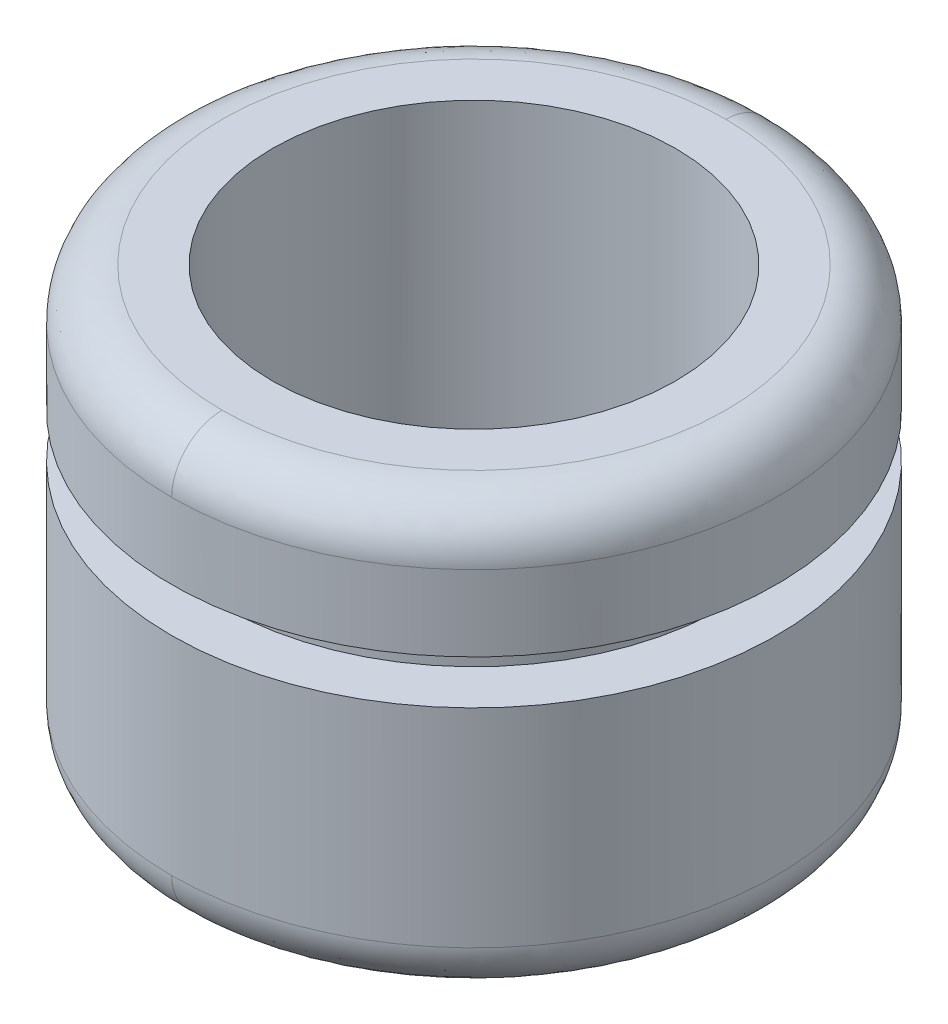
ISO-10303-21;
HEADER;
FILE_DESCRIPTION(('STEP AP214'),'2;1');
FILE_NAME('part.step','',(''),(''),'','','');
FILE_SCHEMA(('AUTOMOTIVE_DESIGN { 1 0 10303 214 1 1 1 1 }'));
ENDSEC;
DATA;
#1=APPLICATION_CONTEXT('core data for automotive mechanical design processes');
#2=APPLICATION_PROTOCOL_DEFINITION('international standard','automotive_design',2000,#1);
#3=PRODUCT_CONTEXT('',#1,'mechanical');
#4=PRODUCT('Part','Part','',(#3));
#5=PRODUCT_RELATED_PRODUCT_CATEGORY('part','',(#4));
#6=PRODUCT_DEFINITION_FORMATION('','',#4);
#7=PRODUCT_DEFINITION_CONTEXT('part definition',#1,'design');
#8=PRODUCT_DEFINITION('design','',#6,#7);
#9=PRODUCT_DEFINITION_SHAPE('','',#8);
#10=(LENGTH_UNIT() NAMED_UNIT(*) SI_UNIT(.MILLI.,.METRE.));
#11=(NAMED_UNIT(*) PLANE_ANGLE_UNIT() SI_UNIT($,.RADIAN.));
#12=(NAMED_UNIT(*) SI_UNIT($,.STERADIAN.) SOLID_ANGLE_UNIT());
#13=UNCERTAINTY_MEASURE_WITH_UNIT(LENGTH_MEASURE(1.E-05),#10,'distance_accuracy_value','');
#14=(GEOMETRIC_REPRESENTATION_CONTEXT(3) GLOBAL_UNCERTAINTY_ASSIGNED_CONTEXT((#13)) GLOBAL_UNIT_ASSIGNED_CONTEXT((#10,
#11,#12)) REPRESENTATION_CONTEXT('',''));
#15=CARTESIAN_POINT('',(0.,0.,0.));
#16=DIRECTION('',(0.,0.,1.));
#17=DIRECTION('',(1.,0.,0.));
#18=AXIS2_PLACEMENT_3D('',#15,#16,#17);
#19=CARTESIAN_POINT('',(0.,10.25,0.));
#20=DIRECTION('',(0.,-1.,0.));
#21=DIRECTION('',(0.,0.,-1.));
#22=AXIS2_PLACEMENT_3D('',#19,#20,#21);
#23=CYLINDRICAL_SURFACE('',#22,12.);
#24=CARTESIAN_POINT('',(0.,10.25,0.));
#25=DIRECTION('',(0.,1.,0.));
#26=DIRECTION('',(0.,0.,1.));
#27=AXIS2_PLACEMENT_3D('',#24,#25,#26);
#28=CIRCLE('',#27,12.);
#29=CARTESIAN_POINT('',(0.,10.25,12.));
#30=VERTEX_POINT('',#29);
#31=EDGE_CURVE('E73',#30,#30,#28,.T.);
#32=ORIENTED_EDGE('',*,*,#31,.F.);
#33=EDGE_LOOP('',(#32));
#34=FACE_BOUND('',#33,.T.);
#35=CARTESIAN_POINT('',(0.,1.99999999888262,0.));
#36=DIRECTION('',(0.,-1.,0.));
#37=DIRECTION('',(0.,0.,-1.));
#38=AXIS2_PLACEMENT_3D('',#35,#36,#37);
#39=CIRCLE('',#38,12.0000000003185);
#40=CARTESIAN_POINT('',(-5.38761770572398E-10,1.99999999916196,-12.0000000002389));
#41=VERTEX_POINT('',#40);
#42=CARTESIAN_POINT('',(-1.23062057109199E-09,1.99999999888262,12.0000000002389));
#43=VERTEX_POINT('',#42);
#44=EDGE_CURVE('E64',#41,#43,#39,.T.);
#45=ORIENTED_EDGE('',*,*,#44,.F.);
#46=CARTESIAN_POINT('',(0.,1.99999999888262,0.));
#47=DIRECTION('',(0.,-1.,0.));
#48=DIRECTION('',(0.,0.,1.));
#49=AXIS2_PLACEMENT_3D('',#46,#47,#48);
#50=CIRCLE('',#49,12.0000000003185);
#51=EDGE_CURVE('E69',#43,#41,#50,.T.);
#52=ORIENTED_EDGE('',*,*,#51,.F.);
#53=EDGE_LOOP('',(#45,#52));
#54=FACE_BOUND('',#53,.T.);
#55=ADVANCED_FACE('F17',(#34,#54),#23,.T.);
#56=CARTESIAN_POINT('',(-12.144,10.25,-12.144));
#57=DIRECTION('',(0.,1.,0.));
#58=DIRECTION('',(0.,0.,1.));
#59=AXIS2_PLACEMENT_3D('',#56,#57,#58);
#60=PLANE('',#59);
#61=CARTESIAN_POINT('',(0.,10.25,0.));
#62=DIRECTION('',(0.,1.,0.));
#63=DIRECTION('',(0.,0.,1.));
#64=AXIS2_PLACEMENT_3D('',#61,#62,#63);
#65=CIRCLE('',#64,10.);
#66=CARTESIAN_POINT('',(0.,10.25,10.));
#67=VERTEX_POINT('',#66);
#68=EDGE_CURVE('E85',#67,#67,#65,.F.);
#69=ORIENTED_EDGE('',*,*,#68,.T.);
#70=EDGE_LOOP('',(#69));
#71=FACE_BOUND('',#70,.T.);
#72=ORIENTED_EDGE('',*,*,#31,.T.);
#73=EDGE_LOOP('',(#72));
#74=FACE_BOUND('',#73,.T.);
#75=ADVANCED_FACE('F125',(#71,#74),#60,.T.);
#76=CARTESIAN_POINT('',(0.,0.009991669,-9.800333167));
#77=CARTESIAN_POINT('',(19.600666333,0.009991669,-9.800333167));
#78=CARTESIAN_POINT('',(19.600666333,0.009991669,9.800333167));
#79=CARTESIAN_POINT('',(0.,0.009991669,9.800333167));
#80=CARTESIAN_POINT('',(0.,-0.126440845,-11.16010753));
#81=CARTESIAN_POINT('',(22.320215061,-0.126440845,-11.16010753));
#82=CARTESIAN_POINT('',(22.320215061,-0.126440845,11.16010753));
#83=CARTESIAN_POINT('',(0.,-0.126440845,11.16010753));
#84=CARTESIAN_POINT('',(0.,0.83989247,-12.126440845));
#85=CARTESIAN_POINT('',(24.252881691,0.83989247,-12.126440845));
#86=CARTESIAN_POINT('',(24.252881691,0.83989247,12.126440845));
#87=CARTESIAN_POINT('',(0.,0.83989247,12.126440845));
#88=CARTESIAN_POINT('',(0.,2.199666833,-11.990008331));
#89=CARTESIAN_POINT('',(23.980016661,2.199666833,-11.990008331));
#90=CARTESIAN_POINT('',(23.980016661,2.199666833,11.990008331));
#91=CARTESIAN_POINT('',(0.,2.199666833,11.990008331));
#92=(BOUNDED_SURFACE() B_SPLINE_SURFACE(3,3,((#76,#77,#78,#79),(#80,#81,#82,#83),(#84,#85,#86,
#87),(#88,#89,#90,#91)),.UNSPECIFIED.,.F.,.F.,.F.) B_SPLINE_SURFACE_WITH_KNOTS((4,4),(4,4),(0.,
1.),(0.,1.),.UNSPECIFIED.) GEOMETRIC_REPRESENTATION_ITEM() RATIONAL_B_SPLINE_SURFACE(((1.,
0.333333333333333,0.333333333333333,1.),(0.755320871117972,0.251773623705991,0.251773623705991,
0.755320871117972),(0.755320871117972,0.251773623705991,0.251773623705991,0.755320871117972),
(1.,0.333333333333333,0.333333333333333,1.))) REPRESENTATION_ITEM('') SURFACE());
#93=CARTESIAN_POINT('',(0.,-3.18488293810218E-10,10.0000000012986));
#94=CARTESIAN_POINT('',(20.0000000018775,-3.1848831384993E-10,10.0000000012986));
#95=CARTESIAN_POINT('',(20.0000000018775,-3.1848831384993E-10,-10.0000000012986));
#96=CARTESIAN_POINT('',(0.,-3.18488293810218E-10,-10.0000000012986));
#97=(BOUNDED_CURVE() B_SPLINE_CURVE(3,(#93,#94,#95,#96),.UNSPECIFIED.,.F.,
.F.) B_SPLINE_CURVE_WITH_KNOTS((4,4),(0.,1.),
.UNSPECIFIED.) CURVE() GEOMETRIC_REPRESENTATION_ITEM() RATIONAL_B_SPLINE_CURVE((0.956578302130087,
0.318859434043362,0.318859434043362,0.956578302130087)) REPRESENTATION_ITEM(''));
#98=CARTESIAN_POINT('',(0.,-1.9109297487728E-10,-9.99999999875893));
#99=VERTEX_POINT('',#98);
#100=CARTESIAN_POINT('',(0.,-1.9109297487728E-10,9.99999999875893));
#101=VERTEX_POINT('',#100);
#102=EDGE_CURVE('E79',#99,#101,#97,.F.);
#103=CARTESIAN_POINT('',(0.,0.009991669,-9.800333167));
#104=CARTESIAN_POINT('',(0.,-0.126440845,-11.16010753));
#105=CARTESIAN_POINT('',(0.,0.83989247,-12.126440845));
#106=CARTESIAN_POINT('',(0.,2.199666833,-11.990008331));
#107=(BOUNDED_CURVE() B_SPLINE_CURVE(3,(#103,#104,#105,#106),.UNSPECIFIED.,.F.,
.F.) B_SPLINE_CURVE_WITH_KNOTS((4,4),(0.,1.),
.UNSPECIFIED.) CURVE() GEOMETRIC_REPRESENTATION_ITEM() RATIONAL_B_SPLINE_CURVE((1.,
0.755320871117972,0.755320871117972,1.)) REPRESENTATION_ITEM(''));
#108=EDGE_CURVE('E76',#41,#99,#107,.F.);
#109=CARTESIAN_POINT('',(0.,0.009991669,9.800333167));
#110=CARTESIAN_POINT('',(0.,-0.126440845,11.16010753));
#111=CARTESIAN_POINT('',(0.,0.83989247,12.126440845));
#112=CARTESIAN_POINT('',(0.,2.199666833,11.990008331));
#113=(BOUNDED_CURVE() B_SPLINE_CURVE(3,(#109,#110,#111,#112),.UNSPECIFIED.,.F.,
.F.) B_SPLINE_CURVE_WITH_KNOTS((4,4),(0.,1.),
.UNSPECIFIED.) CURVE() GEOMETRIC_REPRESENTATION_ITEM() RATIONAL_B_SPLINE_CURVE((1.,
0.755320871117972,0.755320871117972,1.)) REPRESENTATION_ITEM(''));
#114=EDGE_CURVE('E72',#101,#43,#113,.T.);
#115=ORIENTED_EDGE('',*,*,#102,.F.);
#116=ORIENTED_EDGE('',*,*,#108,.F.);
#117=ORIENTED_EDGE('',*,*,#44,.T.);
#118=ORIENTED_EDGE('',*,*,#114,.F.);
#119=EDGE_LOOP('',(#115,#116,#117,#118));
#120=FACE_BOUND('',#119,.T.);
#121=ADVANCED_FACE('F77',(#120),#92,.T.);
#122=CARTESIAN_POINT('',(0.,0.009991669,9.800333167));
#123=CARTESIAN_POINT('',(-19.600666333,0.009991669,9.800333167));
#124=CARTESIAN_POINT('',(-19.600666333,0.009991669,-9.800333167));
#125=CARTESIAN_POINT('',(0.,0.009991669,-9.800333167));
#126=CARTESIAN_POINT('',(0.,-0.126440845,11.16010753));
#127=CARTESIAN_POINT('',(-22.320215061,-0.126440845,11.16010753));
#128=CARTESIAN_POINT('',(-22.320215061,-0.126440845,-11.16010753));
#129=CARTESIAN_POINT('',(0.,-0.126440845,-11.16010753));
#130=CARTESIAN_POINT('',(0.,0.83989247,12.126440845));
#131=CARTESIAN_POINT('',(-24.252881691,0.83989247,12.126440845));
#132=CARTESIAN_POINT('',(-24.252881691,0.83989247,-12.126440845));
#133=CARTESIAN_POINT('',(0.,0.83989247,-12.126440845));
#134=CARTESIAN_POINT('',(0.,2.199666833,11.990008331));
#135=CARTESIAN_POINT('',(-23.980016661,2.199666833,11.990008331));
#136=CARTESIAN_POINT('',(-23.980016661,2.199666833,-11.990008331));
#137=CARTESIAN_POINT('',(0.,2.199666833,-11.990008331));
#138=(BOUNDED_SURFACE() B_SPLINE_SURFACE(3,3,((#122,#123,#124,#125),(#126,#127,#128,#129),(#130,
#131,#132,#133),(#134,#135,#136,#137)),.UNSPECIFIED.,.F.,.F.,
.F.) B_SPLINE_SURFACE_WITH_KNOTS((4,4),(4,4),(0.,1.),(0.,1.),
.UNSPECIFIED.) GEOMETRIC_REPRESENTATION_ITEM() RATIONAL_B_SPLINE_SURFACE(((1.,0.333333333333333,
0.333333333333333,1.),(0.755320871117972,0.251773623705991,0.251773623705991,0.755320871117972),
(0.755320871117972,0.251773623705991,0.251773623705991,0.755320871117972),(1.,0.333333333333333,
0.333333333333333,1.))) REPRESENTATION_ITEM('') SURFACE());
#139=CARTESIAN_POINT('',(0.,-3.18488294030008E-10,-10.0000000012986));
#140=CARTESIAN_POINT('',(-20.0000000018775,-3.18488313654935E-10,-10.0000000012986));
#141=CARTESIAN_POINT('',(-20.0000000018775,-3.18488313654935E-10,10.0000000012986));
#142=CARTESIAN_POINT('',(0.,-3.18488294030008E-10,10.0000000012986));
#143=(BOUNDED_CURVE() B_SPLINE_CURVE(3,(#139,#140,#141,#142),.UNSPECIFIED.,.F.,
.F.) B_SPLINE_CURVE_WITH_KNOTS((4,4),(0.,1.),
.UNSPECIFIED.) CURVE() GEOMETRIC_REPRESENTATION_ITEM() RATIONAL_B_SPLINE_CURVE((0.956578302130087,
0.318859434043362,0.318859434043362,0.956578302130087)) REPRESENTATION_ITEM(''));
#144=EDGE_CURVE('E140',#101,#99,#143,.F.);
#145=ORIENTED_EDGE('',*,*,#108,.T.);
#146=ORIENTED_EDGE('',*,*,#144,.F.);
#147=ORIENTED_EDGE('',*,*,#114,.T.);
#148=ORIENTED_EDGE('',*,*,#51,.T.);
#149=EDGE_LOOP('',(#145,#146,#147,#148));
#150=FACE_BOUND('',#149,.T.);
#151=ADVANCED_FACE('F87',(#150),#138,.T.);
#152=CARTESIAN_POINT('',(0.,12.,0.));
#153=DIRECTION('',(0.,-1.,0.));
#154=DIRECTION('',(0.,0.,-1.));
#155=AXIS2_PLACEMENT_3D('',#152,#153,#154);
#156=CYLINDRICAL_SURFACE('',#155,10.);
#157=CARTESIAN_POINT('',(0.,12.,0.));
#158=DIRECTION('',(0.,-1.,0.));
#159=DIRECTION('',(0.,0.,-1.));
#160=AXIS2_PLACEMENT_3D('',#157,#158,#159);
#161=CIRCLE('',#160,10.);
#162=CARTESIAN_POINT('',(0.,12.,-10.));
#163=VERTEX_POINT('',#162);
#164=EDGE_CURVE('E131',#163,#163,#161,.F.);
#165=ORIENTED_EDGE('',*,*,#164,.F.);
#166=EDGE_LOOP('',(#165));
#167=FACE_BOUND('',#166,.T.);
#168=ORIENTED_EDGE('',*,*,#68,.F.);
#169=EDGE_LOOP('',(#168));
#170=FACE_BOUND('',#169,.T.);
#171=ADVANCED_FACE('F123',(#167,#170),#156,.T.);
#172=CARTESIAN_POINT('',(-10.12,0.,10.12));
#173=DIRECTION('',(0.,-1.,0.));
#174=DIRECTION('',(0.,0.,-1.));
#175=AXIS2_PLACEMENT_3D('',#172,#173,#174);
#176=PLANE('',#175);
#177=CARTESIAN_POINT('',(0.,0.,0.));
#178=DIRECTION('',(0.,-1.,0.));
#179=DIRECTION('',(0.,0.,-1.));
#180=AXIS2_PLACEMENT_3D('',#177,#178,#179);
#181=CIRCLE('',#180,8.);
#182=CARTESIAN_POINT('',(0.,0.,-8.));
#183=VERTEX_POINT('',#182);
#184=EDGE_CURVE('E22',#183,#183,#181,.T.);
#185=ORIENTED_EDGE('',*,*,#184,.F.);
#186=EDGE_LOOP('',(#185));
#187=FACE_BOUND('',#186,.T.);
#188=ORIENTED_EDGE('',*,*,#102,.T.);
#189=ORIENTED_EDGE('',*,*,#144,.T.);
#190=EDGE_LOOP('',(#188,#189));
#191=FACE_BOUND('',#190,.T.);
#192=ADVANCED_FACE('F113',(#187,#191),#176,.T.);
#193=CARTESIAN_POINT('',(-12.144,12.,12.144));
#194=DIRECTION('',(0.,-1.,0.));
#195=DIRECTION('',(0.,0.,-1.));
#196=AXIS2_PLACEMENT_3D('',#193,#194,#195);
#197=PLANE('',#196);
#198=ORIENTED_EDGE('',*,*,#164,.T.);
#199=EDGE_LOOP('',(#198));
#200=FACE_BOUND('',#199,.T.);
#201=CARTESIAN_POINT('',(0.,12.,0.));
#202=DIRECTION('',(0.,-1.,0.));
#203=DIRECTION('',(0.,0.,-1.));
#204=AXIS2_PLACEMENT_3D('',#201,#202,#203);
#205=CIRCLE('',#204,12.);
#206=CARTESIAN_POINT('',(0.,12.,-12.));
#207=VERTEX_POINT('',#206);
#208=EDGE_CURVE('E141',#207,#207,#205,.T.);
#209=ORIENTED_EDGE('',*,*,#208,.T.);
#210=EDGE_LOOP('',(#209));
#211=FACE_BOUND('',#210,.T.);
#212=ADVANCED_FACE('F122',(#200,#211),#197,.T.);
#213=CARTESIAN_POINT('',(0.,17.,0.));
#214=DIRECTION('',(0.,-1.,0.));
#215=DIRECTION('',(0.,0.,-1.));
#216=AXIS2_PLACEMENT_3D('',#213,#214,#215);
#217=CYLINDRICAL_SURFACE('',#216,8.);
#218=ORIENTED_EDGE('',*,*,#184,.T.);
#219=EDGE_LOOP('',(#218));
#220=FACE_BOUND('',#219,.T.);
#221=CARTESIAN_POINT('',(0.,17.,0.));
#222=DIRECTION('',(0.,1.,0.));
#223=DIRECTION('',(0.,0.,1.));
#224=AXIS2_PLACEMENT_3D('',#221,#222,#223);
#225=CIRCLE('',#224,8.);
#226=CARTESIAN_POINT('',(0.,17.,8.));
#227=VERTEX_POINT('',#226);
#228=EDGE_CURVE('E145',#227,#227,#225,.F.);
#229=ORIENTED_EDGE('',*,*,#228,.F.);
#230=EDGE_LOOP('',(#229));
#231=FACE_BOUND('',#230,.T.);
#232=ADVANCED_FACE('F234',(#220,#231),#217,.F.);
#233=CARTESIAN_POINT('',(0.,15.,0.));
#234=DIRECTION('',(0.,-1.,0.));
#235=DIRECTION('',(1.,0.,0.));
#236=AXIS2_PLACEMENT_3D('',#233,#234,#235);
#237=CYLINDRICAL_SURFACE('',#236,12.);
#238=ORIENTED_EDGE('',*,*,#208,.F.);
#239=EDGE_LOOP('',(#238));
#240=FACE_BOUND('',#239,.T.);
#241=CARTESIAN_POINT('',(0.,15.0000000011174,0.));
#242=DIRECTION('',(0.,1.,0.));
#243=DIRECTION('',(0.,0.,1.));
#244=AXIS2_PLACEMENT_3D('',#241,#242,#243);
#245=CIRCLE('',#244,12.0000000003185);
#246=CARTESIAN_POINT('',(-1.23062057109199E-09,15.0000000011174,12.0000000002389));
#247=VERTEX_POINT('',#246);
#248=CARTESIAN_POINT('',(0.,15.000000000838,-12.0000000002389));
#249=VERTEX_POINT('',#248);
#250=EDGE_CURVE('E174',#247,#249,#245,.T.);
#251=ORIENTED_EDGE('',*,*,#250,.F.);
#252=CARTESIAN_POINT('',(0.,15.0000000011174,0.));
#253=DIRECTION('',(0.,1.,0.));
#254=DIRECTION('',(0.,0.,-1.));
#255=AXIS2_PLACEMENT_3D('',#252,#253,#254);
#256=CIRCLE('',#255,12.0000000003185);
#257=EDGE_CURVE('E149',#249,#247,#256,.T.);
#258=ORIENTED_EDGE('',*,*,#257,.F.);
#259=EDGE_LOOP('',(#251,#258));
#260=FACE_BOUND('',#259,.T.);
#261=ADVANCED_FACE('F226',(#240,#260),#237,.T.);
#262=CARTESIAN_POINT('',(-10.12,17.,-10.12));
#263=DIRECTION('',(0.,1.,0.));
#264=DIRECTION('',(0.,0.,1.));
#265=AXIS2_PLACEMENT_3D('',#262,#263,#264);
#266=PLANE('',#265);
#267=ORIENTED_EDGE('',*,*,#228,.T.);
#268=EDGE_LOOP('',(#267));
#269=FACE_BOUND('',#268,.T.);
#270=CARTESIAN_POINT('',(0.,17.0000000003185,-10.0000000012986));
#271=CARTESIAN_POINT('',(20.0000000018775,17.0000000003185,-10.0000000012986));
#272=CARTESIAN_POINT('',(20.0000000018775,17.0000000003185,10.0000000012986));
#273=CARTESIAN_POINT('',(0.,17.0000000003185,10.0000000012986));
#274=(BOUNDED_CURVE() B_SPLINE_CURVE(3,(#270,#271,#272,#273),.UNSPECIFIED.,.F.,
.F.) B_SPLINE_CURVE_WITH_KNOTS((4,4),(0.,1.),
.UNSPECIFIED.) CURVE() GEOMETRIC_REPRESENTATION_ITEM() RATIONAL_B_SPLINE_CURVE((0.956578302130087,
0.318859434043362,0.318859434043362,0.956578302130087)) REPRESENTATION_ITEM(''));
#275=CARTESIAN_POINT('',(0.,17.0000000001911,-9.99999999875893));
#276=VERTEX_POINT('',#275);
#277=CARTESIAN_POINT('',(0.,17.0000000001911,9.99999999875893));
#278=VERTEX_POINT('',#277);
#279=EDGE_CURVE('E29',#276,#278,#274,.T.);
#280=ORIENTED_EDGE('',*,*,#279,.F.);
#281=CARTESIAN_POINT('',(0.,17.0000000003185,10.0000000012986));
#282=CARTESIAN_POINT('',(-20.0000000018775,17.0000000003185,10.0000000012986));
#283=CARTESIAN_POINT('',(-20.0000000018775,17.0000000003185,-10.0000000012986));
#284=CARTESIAN_POINT('',(0.,17.0000000003185,-10.0000000012986));
#285=(BOUNDED_CURVE() B_SPLINE_CURVE(3,(#281,#282,#283,#284),.UNSPECIFIED.,.F.,
.F.) B_SPLINE_CURVE_WITH_KNOTS((4,4),(0.,1.),
.UNSPECIFIED.) CURVE() GEOMETRIC_REPRESENTATION_ITEM() RATIONAL_B_SPLINE_CURVE((0.956578302130087,
0.318859434043362,0.318859434043362,0.956578302130087)) REPRESENTATION_ITEM(''));
#286=EDGE_CURVE('E40',#278,#276,#285,.T.);
#287=ORIENTED_EDGE('',*,*,#286,.F.);
#288=EDGE_LOOP('',(#280,#287));
#289=FACE_BOUND('',#288,.T.);
#290=ADVANCED_FACE('F19',(#269,#289),#266,.T.);
#291=CARTESIAN_POINT('',(0.,16.990008331,-9.800333167));
#292=CARTESIAN_POINT('',(-19.600666333,16.990008331,-9.800333167));
#293=CARTESIAN_POINT('',(-19.600666333,16.990008331,9.800333167));
#294=CARTESIAN_POINT('',(0.,16.990008331,9.800333167));
#295=CARTESIAN_POINT('',(0.,17.126440845,-11.16010753));
#296=CARTESIAN_POINT('',(-22.320215061,17.126440845,-11.16010753));
#297=CARTESIAN_POINT('',(-22.320215061,17.126440845,11.16010753));
#298=CARTESIAN_POINT('',(0.,17.126440845,11.16010753));
#299=CARTESIAN_POINT('',(0.,16.16010753,-12.126440845));
#300=CARTESIAN_POINT('',(-24.252881691,16.16010753,-12.126440845));
#301=CARTESIAN_POINT('',(-24.252881691,16.16010753,12.126440845));
#302=CARTESIAN_POINT('',(0.,16.16010753,12.126440845));
#303=CARTESIAN_POINT('',(0.,14.800333167,-11.990008331));
#304=CARTESIAN_POINT('',(-23.980016661,14.800333167,-11.990008331));
#305=CARTESIAN_POINT('',(-23.980016661,14.800333167,11.990008331));
#306=CARTESIAN_POINT('',(0.,14.800333167,11.990008331));
#307=(BOUNDED_SURFACE() B_SPLINE_SURFACE(3,3,((#291,#292,#293,#294),(#295,#296,#297,#298),(#299,
#300,#301,#302),(#303,#304,#305,#306)),.UNSPECIFIED.,.F.,.F.,
.F.) B_SPLINE_SURFACE_WITH_KNOTS((4,4),(4,4),(0.,1.),(0.,1.),
.UNSPECIFIED.) GEOMETRIC_REPRESENTATION_ITEM() RATIONAL_B_SPLINE_SURFACE(((1.,0.333333333333333,
0.333333333333333,1.),(0.755320871117972,0.251773623705991,0.251773623705991,0.755320871117972),
(0.755320871117972,0.251773623705991,0.251773623705991,0.755320871117972),(1.,0.333333333333333,
0.333333333333333,1.))) REPRESENTATION_ITEM('') SURFACE());
#308=CARTESIAN_POINT('',(0.,16.990008331,9.800333167));
#309=CARTESIAN_POINT('',(0.,17.126440845,11.16010753));
#310=CARTESIAN_POINT('',(0.,16.16010753,12.126440845));
#311=CARTESIAN_POINT('',(0.,14.800333167,11.990008331));
#312=(BOUNDED_CURVE() B_SPLINE_CURVE(3,(#308,#309,#310,#311),.UNSPECIFIED.,.F.,
.F.) B_SPLINE_CURVE_WITH_KNOTS((4,4),(0.,1.),
.UNSPECIFIED.) CURVE() GEOMETRIC_REPRESENTATION_ITEM() RATIONAL_B_SPLINE_CURVE((1.,
0.755320871117972,0.755320871117972,1.)) REPRESENTATION_ITEM(''));
#313=EDGE_CURVE('E11',#278,#247,#312,.T.);
#314=CARTESIAN_POINT('',(0.,16.990008331,-9.800333167));
#315=CARTESIAN_POINT('',(0.,17.126440845,-11.16010753));
#316=CARTESIAN_POINT('',(0.,16.16010753,-12.126440845));
#317=CARTESIAN_POINT('',(0.,14.800333167,-11.990008331));
#318=(BOUNDED_CURVE() B_SPLINE_CURVE(3,(#314,#315,#316,#317),.UNSPECIFIED.,.F.,
.F.) B_SPLINE_CURVE_WITH_KNOTS((4,4),(0.,1.),
.UNSPECIFIED.) CURVE() GEOMETRIC_REPRESENTATION_ITEM() RATIONAL_B_SPLINE_CURVE((1.,
0.755320871117972,0.755320871117972,1.)) REPRESENTATION_ITEM(''));
#319=EDGE_CURVE('E170',#249,#276,#318,.F.);
#320=ORIENTED_EDGE('',*,*,#313,.F.);
#321=ORIENTED_EDGE('',*,*,#286,.T.);
#322=ORIENTED_EDGE('',*,*,#319,.F.);
#323=ORIENTED_EDGE('',*,*,#257,.T.);
#324=EDGE_LOOP('',(#320,#321,#322,#323));
#325=FACE_BOUND('',#324,.T.);
#326=ADVANCED_FACE('F212',(#325),#307,.T.);
#327=CARTESIAN_POINT('',(0.,16.990008331,9.800333167));
#328=CARTESIAN_POINT('',(19.600666333,16.990008331,9.800333167));
#329=CARTESIAN_POINT('',(19.600666333,16.990008331,-9.800333167));
#330=CARTESIAN_POINT('',(0.,16.990008331,-9.800333167));
#331=CARTESIAN_POINT('',(0.,17.126440845,11.16010753));
#332=CARTESIAN_POINT('',(22.320215061,17.126440845,11.16010753));
#333=CARTESIAN_POINT('',(22.320215061,17.126440845,-11.16010753));
#334=CARTESIAN_POINT('',(0.,17.126440845,-11.16010753));
#335=CARTESIAN_POINT('',(0.,16.16010753,12.126440845));
#336=CARTESIAN_POINT('',(24.252881691,16.16010753,12.126440845));
#337=CARTESIAN_POINT('',(24.252881691,16.16010753,-12.126440845));
#338=CARTESIAN_POINT('',(0.,16.16010753,-12.126440845));
#339=CARTESIAN_POINT('',(0.,14.800333167,11.990008331));
#340=CARTESIAN_POINT('',(23.980016661,14.800333167,11.990008331));
#341=CARTESIAN_POINT('',(23.980016661,14.800333167,-11.990008331));
#342=CARTESIAN_POINT('',(0.,14.800333167,-11.990008331));
#343=(BOUNDED_SURFACE() B_SPLINE_SURFACE(3,3,((#327,#328,#329,#330),(#331,#332,#333,#334),(#335,
#336,#337,#338),(#339,#340,#341,#342)),.UNSPECIFIED.,.F.,.F.,
.F.) B_SPLINE_SURFACE_WITH_KNOTS((4,4),(4,4),(0.,1.),(0.,1.),
.UNSPECIFIED.) GEOMETRIC_REPRESENTATION_ITEM() RATIONAL_B_SPLINE_SURFACE(((1.,0.333333333333333,
0.333333333333333,1.),(0.755320871117972,0.251773623705991,0.251773623705991,0.755320871117972),
(0.755320871117972,0.251773623705991,0.251773623705991,0.755320871117972),(1.,0.333333333333333,
0.333333333333333,1.))) REPRESENTATION_ITEM('') SURFACE());
#344=ORIENTED_EDGE('',*,*,#279,.T.);
#345=ORIENTED_EDGE('',*,*,#313,.T.);
#346=ORIENTED_EDGE('',*,*,#250,.T.);
#347=ORIENTED_EDGE('',*,*,#319,.T.);
#348=EDGE_LOOP('',(#344,#345,#346,#347));
#349=FACE_BOUND('',#348,.T.);
#350=ADVANCED_FACE('F173',(#349),#343,.T.);
#351=CLOSED_SHELL('',(#55,#75,#121,#151,#171,#192,#212,#232,#261,#290,#326,#350));
#352=MANIFOLD_SOLID_BREP('B1',#351);
#353=ADVANCED_BREP_SHAPE_REPRESENTATION('',(#18,#352),#14);
#354=SHAPE_DEFINITION_REPRESENTATION(#9,#353);
ENDSEC;
END-ISO-10303-21;
